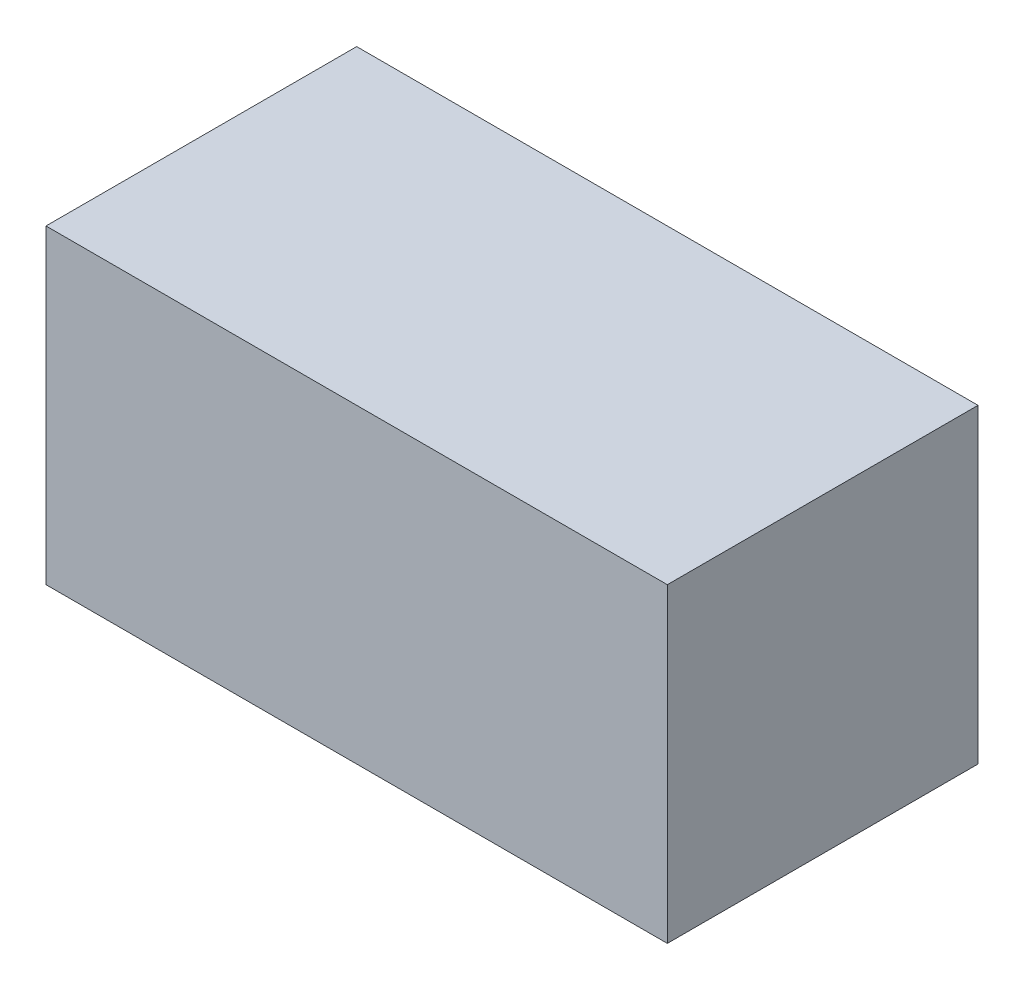
ISO-10303-21;
HEADER;
FILE_DESCRIPTION(('STEP AP214'),'2;1');
FILE_NAME('part.step','',(''),(''),'','','');
FILE_SCHEMA(('AUTOMOTIVE_DESIGN { 1 0 10303 214 1 1 1 1 }'));
ENDSEC;
DATA;
#1=APPLICATION_CONTEXT('core data for automotive mechanical design processes');
#2=APPLICATION_PROTOCOL_DEFINITION('international standard','automotive_design',2000,#1);
#3=PRODUCT_CONTEXT('',#1,'mechanical');
#4=PRODUCT('Part','Part','',(#3));
#5=PRODUCT_RELATED_PRODUCT_CATEGORY('part','',(#4));
#6=PRODUCT_DEFINITION_FORMATION('','',#4);
#7=PRODUCT_DEFINITION_CONTEXT('part definition',#1,'design');
#8=PRODUCT_DEFINITION('design','',#6,#7);
#9=PRODUCT_DEFINITION_SHAPE('','',#8);
#10=(LENGTH_UNIT() NAMED_UNIT(*) SI_UNIT(.MILLI.,.METRE.));
#11=(NAMED_UNIT(*) PLANE_ANGLE_UNIT() SI_UNIT($,.RADIAN.));
#12=(NAMED_UNIT(*) SI_UNIT($,.STERADIAN.) SOLID_ANGLE_UNIT());
#13=UNCERTAINTY_MEASURE_WITH_UNIT(LENGTH_MEASURE(1.E-05),#10,'distance_accuracy_value','');
#14=(GEOMETRIC_REPRESENTATION_CONTEXT(3) GLOBAL_UNCERTAINTY_ASSIGNED_CONTEXT((#13)) GLOBAL_UNIT_ASSIGNED_CONTEXT((#10,
#11,#12)) REPRESENTATION_CONTEXT('',''));
#15=CARTESIAN_POINT('',(0.,0.,0.));
#16=DIRECTION('',(0.,0.,1.));
#17=DIRECTION('',(1.,0.,0.));
#18=AXIS2_PLACEMENT_3D('',#15,#16,#17);
#19=CARTESIAN_POINT('',(50.,50.,-25.));
#20=DIRECTION('',(-1.,0.,0.));
#21=DIRECTION('',(0.,0.,1.));
#22=AXIS2_PLACEMENT_3D('',#19,#20,#21);
#23=PLANE('',#22);
#24=DIRECTION('',(0.,0.,-1.));
#25=VECTOR('',#24,1.);
#26=CARTESIAN_POINT('',(50.,0.,-25.));
#27=LINE('',#26,#25);
#28=CARTESIAN_POINT('',(50.,0.,25.));
#29=VERTEX_POINT('',#28);
#30=CARTESIAN_POINT('',(50.,0.,-25.));
#31=VERTEX_POINT('',#30);
#32=EDGE_CURVE('E96',#29,#31,#27,.T.);
#33=ORIENTED_EDGE('',*,*,#32,.T.);
#34=DIRECTION('',(0.,-1.,0.));
#35=VECTOR('',#34,1.);
#36=CARTESIAN_POINT('',(50.,50.,-25.));
#37=LINE('',#36,#35);
#38=CARTESIAN_POINT('',(50.,50.,-25.));
#39=VERTEX_POINT('',#38);
#40=EDGE_CURVE('E11',#39,#31,#37,.T.);
#41=ORIENTED_EDGE('',*,*,#40,.F.);
#42=DIRECTION('',(0.,0.,-1.));
#43=VECTOR('',#42,1.);
#44=CARTESIAN_POINT('',(50.,50.,-25.));
#45=LINE('',#44,#43);
#46=CARTESIAN_POINT('',(50.,50.,25.));
#47=VERTEX_POINT('',#46);
#48=EDGE_CURVE('E84',#47,#39,#45,.T.);
#49=ORIENTED_EDGE('',*,*,#48,.F.);
#50=DIRECTION('',(0.,-1.,0.));
#51=VECTOR('',#50,1.);
#52=CARTESIAN_POINT('',(50.,50.,25.));
#53=LINE('',#52,#51);
#54=EDGE_CURVE('E92',#47,#29,#53,.T.);
#55=ORIENTED_EDGE('',*,*,#54,.T.);
#56=EDGE_LOOP('',(#33,#41,#49,#55));
#57=FACE_BOUND('',#56,.T.);
#58=ADVANCED_FACE('F33',(#57),#23,.F.);
#59=CARTESIAN_POINT('',(-50.,50.,-25.));
#60=DIRECTION('',(0.,0.,1.));
#61=DIRECTION('',(1.,0.,0.));
#62=AXIS2_PLACEMENT_3D('',#59,#60,#61);
#63=PLANE('',#62);
#64=DIRECTION('',(-1.,0.,0.));
#65=VECTOR('',#64,1.);
#66=CARTESIAN_POINT('',(-50.,0.,-25.));
#67=LINE('',#66,#65);
#68=CARTESIAN_POINT('',(-50.,0.,-25.));
#69=VERTEX_POINT('',#68);
#70=EDGE_CURVE('E88',#31,#69,#67,.T.);
#71=ORIENTED_EDGE('',*,*,#70,.T.);
#72=DIRECTION('',(0.,-1.,0.));
#73=VECTOR('',#72,1.);
#74=CARTESIAN_POINT('',(-50.,50.,-25.));
#75=LINE('',#74,#73);
#76=CARTESIAN_POINT('',(-50.,50.,-25.));
#77=VERTEX_POINT('',#76);
#78=EDGE_CURVE('E41',#77,#69,#75,.T.);
#79=ORIENTED_EDGE('',*,*,#78,.F.);
#80=DIRECTION('',(-1.,0.,0.));
#81=VECTOR('',#80,1.);
#82=CARTESIAN_POINT('',(-50.,50.,-25.));
#83=LINE('',#82,#81);
#84=EDGE_CURVE('E79',#39,#77,#83,.T.);
#85=ORIENTED_EDGE('',*,*,#84,.F.);
#86=ORIENTED_EDGE('',*,*,#40,.T.);
#87=EDGE_LOOP('',(#71,#79,#85,#86));
#88=FACE_BOUND('',#87,.T.);
#89=ADVANCED_FACE('F87',(#88),#63,.F.);
#90=CARTESIAN_POINT('',(-50.,50.,-25.));
#91=DIRECTION('',(1.,0.,0.));
#92=DIRECTION('',(0.,0.,-1.));
#93=AXIS2_PLACEMENT_3D('',#90,#91,#92);
#94=PLANE('',#93);
#95=DIRECTION('',(0.,0.,1.));
#96=VECTOR('',#95,1.);
#97=CARTESIAN_POINT('',(-50.,0.,-25.));
#98=LINE('',#97,#96);
#99=CARTESIAN_POINT('',(-50.,0.,25.));
#100=VERTEX_POINT('',#99);
#101=EDGE_CURVE('E66',#69,#100,#98,.T.);
#102=ORIENTED_EDGE('',*,*,#101,.T.);
#103=DIRECTION('',(0.,-1.,0.));
#104=VECTOR('',#103,1.);
#105=CARTESIAN_POINT('',(-50.,50.,25.));
#106=LINE('',#105,#104);
#107=CARTESIAN_POINT('',(-50.,50.,25.));
#108=VERTEX_POINT('',#107);
#109=EDGE_CURVE('E89',#108,#100,#106,.T.);
#110=ORIENTED_EDGE('',*,*,#109,.F.);
#111=DIRECTION('',(0.,0.,1.));
#112=VECTOR('',#111,1.);
#113=CARTESIAN_POINT('',(-50.,50.,-25.));
#114=LINE('',#113,#112);
#115=EDGE_CURVE('E82',#77,#108,#114,.T.);
#116=ORIENTED_EDGE('',*,*,#115,.F.);
#117=ORIENTED_EDGE('',*,*,#78,.T.);
#118=EDGE_LOOP('',(#102,#110,#116,#117));
#119=FACE_BOUND('',#118,.T.);
#120=ADVANCED_FACE('F90',(#119),#94,.F.);
#121=CARTESIAN_POINT('',(-50.,50.,25.));
#122=DIRECTION('',(0.,0.,-1.));
#123=DIRECTION('',(-1.,0.,0.));
#124=AXIS2_PLACEMENT_3D('',#121,#122,#123);
#125=PLANE('',#124);
#126=DIRECTION('',(1.,0.,0.));
#127=VECTOR('',#126,1.);
#128=CARTESIAN_POINT('',(-50.,0.,25.));
#129=LINE('',#128,#127);
#130=EDGE_CURVE('E72',#100,#29,#129,.T.);
#131=ORIENTED_EDGE('',*,*,#130,.T.);
#132=ORIENTED_EDGE('',*,*,#54,.F.);
#133=DIRECTION('',(1.,0.,0.));
#134=VECTOR('',#133,1.);
#135=CARTESIAN_POINT('',(-50.,50.,25.));
#136=LINE('',#135,#134);
#137=EDGE_CURVE('E49',#108,#47,#136,.T.);
#138=ORIENTED_EDGE('',*,*,#137,.F.);
#139=ORIENTED_EDGE('',*,*,#109,.T.);
#140=EDGE_LOOP('',(#131,#132,#138,#139));
#141=FACE_BOUND('',#140,.T.);
#142=ADVANCED_FACE('F103',(#141),#125,.F.);
#143=CARTESIAN_POINT('',(0.,50.,0.));
#144=DIRECTION('',(0.,1.,0.));
#145=DIRECTION('',(0.,0.,1.));
#146=AXIS2_PLACEMENT_3D('',#143,#144,#145);
#147=PLANE('',#146);
#148=ORIENTED_EDGE('',*,*,#48,.T.);
#149=ORIENTED_EDGE('',*,*,#84,.T.);
#150=ORIENTED_EDGE('',*,*,#115,.T.);
#151=ORIENTED_EDGE('',*,*,#137,.T.);
#152=EDGE_LOOP('',(#148,#149,#150,#151));
#153=FACE_BOUND('',#152,.T.);
#154=ADVANCED_FACE('F80',(#153),#147,.T.);
#155=CARTESIAN_POINT('',(0.,0.,0.));
#156=DIRECTION('',(0.,1.,0.));
#157=DIRECTION('',(0.,0.,1.));
#158=AXIS2_PLACEMENT_3D('',#155,#156,#157);
#159=PLANE('',#158);
#160=ORIENTED_EDGE('',*,*,#32,.F.);
#161=ORIENTED_EDGE('',*,*,#130,.F.);
#162=ORIENTED_EDGE('',*,*,#101,.F.);
#163=ORIENTED_EDGE('',*,*,#70,.F.);
#164=EDGE_LOOP('',(#160,#161,#162,#163));
#165=FACE_BOUND('',#164,.T.);
#166=ADVANCED_FACE('F106',(#165),#159,.F.);
#167=CLOSED_SHELL('',(#58,#89,#120,#142,#154,#166));
#168=MANIFOLD_SOLID_BREP('B2',#167);
#169=ADVANCED_BREP_SHAPE_REPRESENTATION('',(#18,#168),#14);
#170=SHAPE_DEFINITION_REPRESENTATION(#9,#169);
ENDSEC;
END-ISO-10303-21;
